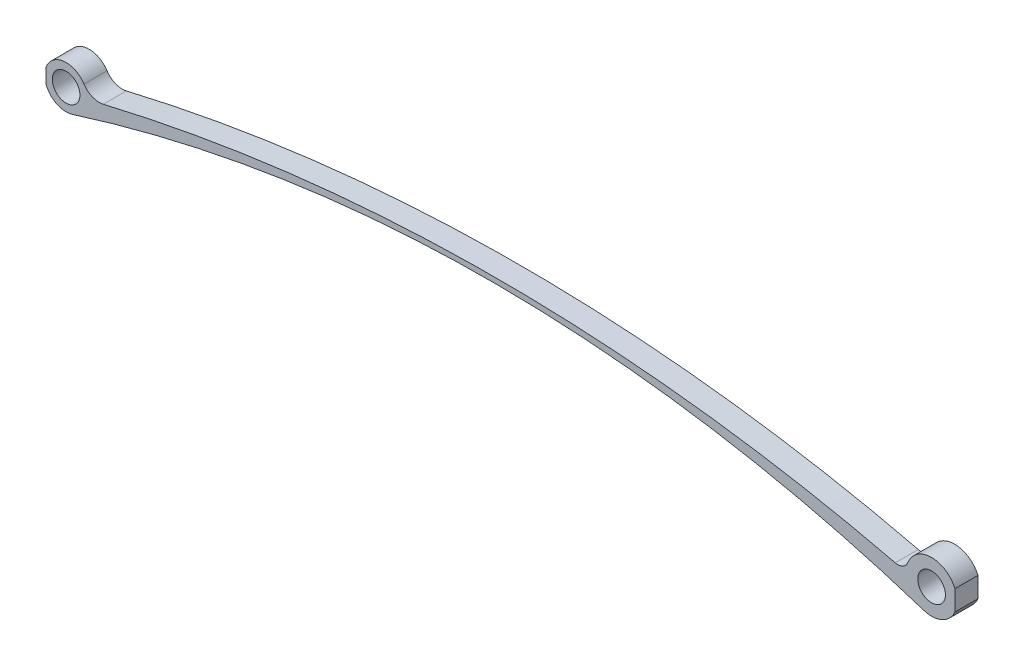
ISO-10303-21;
HEADER;
FILE_DESCRIPTION(('STEP AP214'),'2;1');
FILE_NAME('part.step','',(''),(''),'','','');
FILE_SCHEMA(('AUTOMOTIVE_DESIGN { 1 0 10303 214 1 1 1 1 }'));
ENDSEC;
DATA;
#1=APPLICATION_CONTEXT('core data for automotive mechanical design processes');
#2=APPLICATION_PROTOCOL_DEFINITION('international standard','automotive_design',2000,#1);
#3=PRODUCT_CONTEXT('',#1,'mechanical');
#4=PRODUCT('Part','Part','',(#3));
#5=PRODUCT_RELATED_PRODUCT_CATEGORY('part','',(#4));
#6=PRODUCT_DEFINITION_FORMATION('','',#4);
#7=PRODUCT_DEFINITION_CONTEXT('part definition',#1,'design');
#8=PRODUCT_DEFINITION('design','',#6,#7);
#9=PRODUCT_DEFINITION_SHAPE('','',#8);
#10=(LENGTH_UNIT() NAMED_UNIT(*) SI_UNIT(.MILLI.,.METRE.));
#11=(NAMED_UNIT(*) PLANE_ANGLE_UNIT() SI_UNIT($,.RADIAN.));
#12=(NAMED_UNIT(*) SI_UNIT($,.STERADIAN.) SOLID_ANGLE_UNIT());
#13=UNCERTAINTY_MEASURE_WITH_UNIT(LENGTH_MEASURE(1.E-05),#10,'distance_accuracy_value','');
#14=(GEOMETRIC_REPRESENTATION_CONTEXT(3) GLOBAL_UNCERTAINTY_ASSIGNED_CONTEXT((#13)) GLOBAL_UNIT_ASSIGNED_CONTEXT((#10,
#11,#12)) REPRESENTATION_CONTEXT('',''));
#15=CARTESIAN_POINT('',(0.,0.,0.));
#16=DIRECTION('',(0.,0.,1.));
#17=DIRECTION('',(1.,0.,0.));
#18=AXIS2_PLACEMENT_3D('',#15,#16,#17);
#19=CARTESIAN_POINT('',(46.2166343916436,-145.804835685392,5.));
#20=DIRECTION('',(0.,0.,1.));
#21=DIRECTION('',(1.,0.,0.));
#22=AXIS2_PLACEMENT_3D('',#19,#20,#21);
#23=PLANE('',#22);
#24=CARTESIAN_POINT('',(0.,0.,5.));
#25=DIRECTION('',(0.,0.,1.));
#26=DIRECTION('',(1.,0.,0.));
#27=AXIS2_PLACEMENT_3D('',#24,#25,#26);
#28=CIRCLE('',#27,3.00000007924961);
#29=CARTESIAN_POINT('',(3.00000007924961,0.,5.));
#30=VERTEX_POINT('',#29);
#31=EDGE_CURVE('E177',#30,#30,#28,.T.);
#32=ORIENTED_EDGE('',*,*,#31,.F.);
#33=EDGE_LOOP('',(#32));
#34=FACE_BOUND('',#33,.T.);
#35=CARTESIAN_POINT('',(187.7624,0.,5.));
#36=DIRECTION('',(0.,0.,1.));
#37=DIRECTION('',(1.,0.,0.));
#38=AXIS2_PLACEMENT_3D('',#35,#36,#37);
#39=CIRCLE('',#38,3.00000007924962);
#40=CARTESIAN_POINT('',(190.76240007925,0.,5.));
#41=VERTEX_POINT('',#40);
#42=EDGE_CURVE('E207',#41,#41,#39,.T.);
#43=ORIENTED_EDGE('',*,*,#42,.F.);
#44=EDGE_LOOP('',(#43));
#45=FACE_BOUND('',#44,.T.);
#46=CARTESIAN_POINT('',(0.,0.,5.));
#47=DIRECTION('',(0.,0.,1.));
#48=DIRECTION('',(1.,0.,0.));
#49=AXIS2_PLACEMENT_3D('',#46,#47,#48);
#50=CIRCLE('',#49,4.63518821296482);
#51=CARTESIAN_POINT('',(3.8882462198226,2.52319462262491,5.));
#52=VERTEX_POINT('',#51);
#53=CARTESIAN_POINT('',(-4.35681947691644,1.58211687784737,5.));
#54=VERTEX_POINT('',#53);
#55=EDGE_CURVE('E142',#52,#54,#50,.T.);
#56=ORIENTED_EDGE('',*,*,#55,.T.);
#57=DIRECTION('',(0.,1.,0.));
#58=VECTOR('',#57,1.);
#59=CARTESIAN_POINT('',(-4.35681947691644,0.,5.));
#60=LINE('',#59,#58);
#61=CARTESIAN_POINT('',(-4.35681947691644,-1.58211687784737,5.));
#62=VERTEX_POINT('',#61);
#63=EDGE_CURVE('E112',#62,#54,#60,.T.);
#64=ORIENTED_EDGE('',*,*,#63,.F.);
#65=CARTESIAN_POINT('',(1.40056706748754,-4.41852709158576,5.));
#66=VERTEX_POINT('',#65);
#67=EDGE_CURVE('E162',#62,#66,#50,.T.);
#68=ORIENTED_EDGE('',*,*,#67,.T.);
#69=CARTESIAN_POINT('',(92.4332687832871,-291.609671370783,5.));
#70=DIRECTION('',(0.,0.,-1.));
#71=DIRECTION('',(1.,0.,0.));
#72=AXIS2_PLACEMENT_3D('',#69,#70,#71);
#73=CIRCLE('',#72,301.273473996754);
#74=CARTESIAN_POINT('',(186.046385231382,-5.24925063679274,5.));
#75=VERTEX_POINT('',#74);
#76=EDGE_CURVE('E130',#66,#75,#73,.T.);
#77=ORIENTED_EDGE('',*,*,#76,.T.);
#78=CARTESIAN_POINT('',(187.7624,0.,5.));
#79=DIRECTION('',(0.,0.,1.));
#80=DIRECTION('',(1.,0.,0.));
#81=AXIS2_PLACEMENT_3D('',#78,#79,#80);
#82=CIRCLE('',#81,5.52262065816451);
#83=CARTESIAN_POINT('',(192.829341952088,-2.19668800428202,5.));
#84=VERTEX_POINT('',#83);
#85=EDGE_CURVE('E199',#75,#84,#82,.T.);
#86=ORIENTED_EDGE('',*,*,#85,.T.);
#87=DIRECTION('',(0.,-1.,0.));
#88=VECTOR('',#87,1.);
#89=CARTESIAN_POINT('',(192.829341952088,0.,5.));
#90=LINE('',#89,#88);
#91=CARTESIAN_POINT('',(192.829341952088,2.19668800428202,5.));
#92=VERTEX_POINT('',#91);
#93=EDGE_CURVE('E213',#92,#84,#90,.T.);
#94=ORIENTED_EDGE('',*,*,#93,.F.);
#95=CARTESIAN_POINT('',(182.617563383435,2.00748477524475,5.));
#96=VERTEX_POINT('',#95);
#97=EDGE_CURVE('E133',#92,#96,#82,.T.);
#98=ORIENTED_EDGE('',*,*,#97,.T.);
#99=CARTESIAN_POINT('',(180.426802915237,2.86230653420144,5.));
#100=DIRECTION('',(0.,0.,-1.));
#101=DIRECTION('',(1.,0.,0.));
#102=AXIS2_PLACEMENT_3D('',#99,#100,#101);
#103=CIRCLE('',#102,2.35162745106603);
#104=CARTESIAN_POINT('',(179.877474491306,0.575739248668494,5.));
#105=VERTEX_POINT('',#104);
#106=EDGE_CURVE('E198',#96,#105,#103,.T.);
#107=ORIENTED_EDGE('',*,*,#106,.T.);
#108=CARTESIAN_POINT('',(93.4374837774001,-359.228789914366,5.));
#109=DIRECTION('',(0.,0.,1.));
#110=DIRECTION('',(1.,0.,0.));
#111=AXIS2_PLACEMENT_3D('',#108,#109,#110);
#112=CIRCLE('',#111,370.042120846875);
#113=CARTESIAN_POINT('',(8.09398783884522,0.837396920553271,5.));
#114=VERTEX_POINT('',#113);
#115=EDGE_CURVE('E169',#105,#114,#112,.T.);
#116=ORIENTED_EDGE('',*,*,#115,.T.);
#117=CARTESIAN_POINT('',(7.18703059895712,4.66387053049246,5.));
#118=DIRECTION('',(0.,0.,-1.));
#119=DIRECTION('',(1.,0.,0.));
#120=AXIS2_PLACEMENT_3D('',#117,#118,#119);
#121=CIRCLE('',#120,3.93248925269307);
#122=EDGE_CURVE('E167',#114,#52,#121,.T.);
#123=ORIENTED_EDGE('',*,*,#122,.T.);
#124=EDGE_LOOP('',(#56,#64,#68,#77,#86,#94,#98,#107,#116,#123));
#125=FACE_BOUND('',#124,.T.);
#126=ADVANCED_FACE('F36',(#34,#45,#125),#23,.T.);
#127=CARTESIAN_POINT('',(46.2166343916436,-145.804835685392,0.));
#128=DIRECTION('',(0.,0.,1.));
#129=DIRECTION('',(1.,0.,0.));
#130=AXIS2_PLACEMENT_3D('',#127,#128,#129);
#131=PLANE('',#130);
#132=CARTESIAN_POINT('',(0.,0.,0.));
#133=DIRECTION('',(0.,0.,1.));
#134=DIRECTION('',(1.,0.,0.));
#135=AXIS2_PLACEMENT_3D('',#132,#133,#134);
#136=CIRCLE('',#135,3.00000007924961);
#137=CARTESIAN_POINT('',(3.00000007924961,0.,0.));
#138=VERTEX_POINT('',#137);
#139=EDGE_CURVE('E204',#138,#138,#136,.T.);
#140=ORIENTED_EDGE('',*,*,#139,.T.);
#141=EDGE_LOOP('',(#140));
#142=FACE_BOUND('',#141,.T.);
#143=CARTESIAN_POINT('',(187.7624,0.,0.));
#144=DIRECTION('',(0.,0.,1.));
#145=DIRECTION('',(1.,0.,0.));
#146=AXIS2_PLACEMENT_3D('',#143,#144,#145);
#147=CIRCLE('',#146,3.00000007924962);
#148=CARTESIAN_POINT('',(190.76240007925,0.,0.));
#149=VERTEX_POINT('',#148);
#150=EDGE_CURVE('E210',#149,#149,#147,.T.);
#151=ORIENTED_EDGE('',*,*,#150,.T.);
#152=EDGE_LOOP('',(#151));
#153=FACE_BOUND('',#152,.T.);
#154=DIRECTION('',(0.,1.,0.));
#155=VECTOR('',#154,1.);
#156=CARTESIAN_POINT('',(-4.35681947691644,0.,0.));
#157=LINE('',#156,#155);
#158=CARTESIAN_POINT('',(-4.35681947691644,-1.58211687784737,0.));
#159=VERTEX_POINT('',#158);
#160=CARTESIAN_POINT('',(-4.35681947691644,1.58211687784737,0.));
#161=VERTEX_POINT('',#160);
#162=EDGE_CURVE('E50',#159,#161,#157,.T.);
#163=ORIENTED_EDGE('',*,*,#162,.T.);
#164=CARTESIAN_POINT('',(0.,0.,0.));
#165=DIRECTION('',(0.,0.,1.));
#166=DIRECTION('',(1.,0.,0.));
#167=AXIS2_PLACEMENT_3D('',#164,#165,#166);
#168=CIRCLE('',#167,4.63518821296482);
#169=CARTESIAN_POINT('',(3.8882462198226,2.52319462262491,0.));
#170=VERTEX_POINT('',#169);
#171=EDGE_CURVE('E122',#170,#161,#168,.T.);
#172=ORIENTED_EDGE('',*,*,#171,.F.);
#173=CARTESIAN_POINT('',(7.18703059895712,4.66387053049246,0.));
#174=DIRECTION('',(0.,0.,-1.));
#175=DIRECTION('',(1.,0.,0.));
#176=AXIS2_PLACEMENT_3D('',#173,#174,#175);
#177=CIRCLE('',#176,3.93248925269307);
#178=CARTESIAN_POINT('',(8.09398783884522,0.837396920553271,0.));
#179=VERTEX_POINT('',#178);
#180=EDGE_CURVE('E135',#179,#170,#177,.T.);
#181=ORIENTED_EDGE('',*,*,#180,.F.);
#182=CARTESIAN_POINT('',(93.4374837774001,-359.228789914366,0.));
#183=DIRECTION('',(0.,0.,1.));
#184=DIRECTION('',(1.,0.,0.));
#185=AXIS2_PLACEMENT_3D('',#182,#183,#184);
#186=CIRCLE('',#185,370.042120846875);
#187=CARTESIAN_POINT('',(179.877474491306,0.575739248668494,0.));
#188=VERTEX_POINT('',#187);
#189=EDGE_CURVE('E182',#188,#179,#186,.T.);
#190=ORIENTED_EDGE('',*,*,#189,.F.);
#191=CARTESIAN_POINT('',(180.426802915237,2.86230653420144,0.));
#192=DIRECTION('',(0.,0.,-1.));
#193=DIRECTION('',(1.,0.,0.));
#194=AXIS2_PLACEMENT_3D('',#191,#192,#193);
#195=CIRCLE('',#194,2.35162745106603);
#196=CARTESIAN_POINT('',(182.617563383435,2.00748477524475,0.));
#197=VERTEX_POINT('',#196);
#198=EDGE_CURVE('E181',#197,#188,#195,.T.);
#199=ORIENTED_EDGE('',*,*,#198,.F.);
#200=CARTESIAN_POINT('',(187.7624,0.,0.));
#201=DIRECTION('',(0.,0.,1.));
#202=DIRECTION('',(1.,0.,0.));
#203=AXIS2_PLACEMENT_3D('',#200,#201,#202);
#204=CIRCLE('',#203,5.52262065816451);
#205=CARTESIAN_POINT('',(192.829341952088,2.19668800428202,0.));
#206=VERTEX_POINT('',#205);
#207=EDGE_CURVE('E176',#206,#197,#204,.T.);
#208=ORIENTED_EDGE('',*,*,#207,.F.);
#209=DIRECTION('',(0.,-1.,0.));
#210=VECTOR('',#209,1.);
#211=CARTESIAN_POINT('',(192.829341952088,0.,0.));
#212=LINE('',#211,#210);
#213=CARTESIAN_POINT('',(192.829341952088,-2.19668800428202,0.));
#214=VERTEX_POINT('',#213);
#215=EDGE_CURVE('E58',#206,#214,#212,.T.);
#216=ORIENTED_EDGE('',*,*,#215,.T.);
#217=CARTESIAN_POINT('',(186.046385231382,-5.24925063679274,0.));
#218=VERTEX_POINT('',#217);
#219=EDGE_CURVE('E178',#218,#214,#204,.T.);
#220=ORIENTED_EDGE('',*,*,#219,.F.);
#221=CARTESIAN_POINT('',(92.4332687832871,-291.609671370783,0.));
#222=DIRECTION('',(0.,0.,-1.));
#223=DIRECTION('',(1.,0.,0.));
#224=AXIS2_PLACEMENT_3D('',#221,#222,#223);
#225=CIRCLE('',#224,301.273473996754);
#226=CARTESIAN_POINT('',(1.40056706748754,-4.41852709158576,0.));
#227=VERTEX_POINT('',#226);
#228=EDGE_CURVE('E173',#227,#218,#225,.T.);
#229=ORIENTED_EDGE('',*,*,#228,.F.);
#230=EDGE_CURVE('E124',#159,#227,#168,.T.);
#231=ORIENTED_EDGE('',*,*,#230,.F.);
#232=EDGE_LOOP('',(#163,#172,#181,#190,#199,#208,#216,#220,#229,#231));
#233=FACE_BOUND('',#232,.T.);
#234=ADVANCED_FACE('F120',(#142,#153,#233),#131,.F.);
#235=CARTESIAN_POINT('',(0.,0.,5.));
#236=DIRECTION('',(0.,0.,-1.));
#237=DIRECTION('',(-1.,0.,0.));
#238=AXIS2_PLACEMENT_3D('',#235,#236,#237);
#239=CYLINDRICAL_SURFACE('',#238,4.63518821296482);
#240=DIRECTION('',(0.,0.,-1.));
#241=VECTOR('',#240,1.);
#242=CARTESIAN_POINT('',(-4.35681947691644,1.58211687784737,5.));
#243=LINE('',#242,#241);
#244=EDGE_CURVE('E11',#54,#161,#243,.T.);
#245=ORIENTED_EDGE('',*,*,#244,.F.);
#246=ORIENTED_EDGE('',*,*,#55,.F.);
#247=DIRECTION('',(0.,0.,-1.));
#248=VECTOR('',#247,1.);
#249=CARTESIAN_POINT('',(3.8882462198226,2.52319462262491,5.));
#250=LINE('',#249,#248);
#251=EDGE_CURVE('E129',#52,#170,#250,.T.);
#252=ORIENTED_EDGE('',*,*,#251,.T.);
#253=ORIENTED_EDGE('',*,*,#171,.T.);
#254=EDGE_LOOP('',(#245,#246,#252,#253));
#255=FACE_BOUND('',#254,.T.);
#256=ADVANCED_FACE('F127',(#255),#239,.T.);
#257=DIRECTION('',(0.,0.,-1.));
#258=VECTOR('',#257,1.);
#259=CARTESIAN_POINT('',(-4.35681947691644,-1.58211687784737,5.));
#260=LINE('',#259,#258);
#261=EDGE_CURVE('E44',#159,#62,#260,.F.);
#262=ORIENTED_EDGE('',*,*,#261,.F.);
#263=ORIENTED_EDGE('',*,*,#230,.T.);
#264=DIRECTION('',(0.,0.,-1.));
#265=VECTOR('',#264,1.);
#266=CARTESIAN_POINT('',(1.40056706748754,-4.41852709158576,5.));
#267=LINE('',#266,#265);
#268=EDGE_CURVE('E139',#66,#227,#267,.T.);
#269=ORIENTED_EDGE('',*,*,#268,.F.);
#270=ORIENTED_EDGE('',*,*,#67,.F.);
#271=EDGE_LOOP('',(#262,#263,#269,#270));
#272=FACE_BOUND('',#271,.T.);
#273=ADVANCED_FACE('F165',(#272),#239,.T.);
#274=CARTESIAN_POINT('',(187.7624,0.,5.));
#275=DIRECTION('',(0.,0.,-1.));
#276=DIRECTION('',(-1.,0.,0.));
#277=AXIS2_PLACEMENT_3D('',#274,#275,#276);
#278=CYLINDRICAL_SURFACE('',#277,5.52262065816451);
#279=DIRECTION('',(0.,0.,-1.));
#280=VECTOR('',#279,1.);
#281=CARTESIAN_POINT('',(192.829341952088,-2.19668800428202,5.));
#282=LINE('',#281,#280);
#283=EDGE_CURVE('E158',#84,#214,#282,.T.);
#284=ORIENTED_EDGE('',*,*,#283,.F.);
#285=ORIENTED_EDGE('',*,*,#85,.F.);
#286=DIRECTION('',(0.,0.,-1.));
#287=VECTOR('',#286,1.);
#288=CARTESIAN_POINT('',(186.046385231382,-5.24925063679274,5.));
#289=LINE('',#288,#287);
#290=EDGE_CURVE('E153',#75,#218,#289,.T.);
#291=ORIENTED_EDGE('',*,*,#290,.T.);
#292=ORIENTED_EDGE('',*,*,#219,.T.);
#293=EDGE_LOOP('',(#284,#285,#291,#292));
#294=FACE_BOUND('',#293,.T.);
#295=ADVANCED_FACE('F222',(#294),#278,.T.);
#296=DIRECTION('',(0.,0.,-1.));
#297=VECTOR('',#296,1.);
#298=CARTESIAN_POINT('',(192.829341952088,2.19668800428202,5.));
#299=LINE('',#298,#297);
#300=EDGE_CURVE('E156',#206,#92,#299,.F.);
#301=ORIENTED_EDGE('',*,*,#300,.F.);
#302=ORIENTED_EDGE('',*,*,#207,.T.);
#303=DIRECTION('',(0.,0.,-1.));
#304=VECTOR('',#303,1.);
#305=CARTESIAN_POINT('',(182.617563383435,2.00748477524475,5.));
#306=LINE('',#305,#304);
#307=EDGE_CURVE('E150',#96,#197,#306,.T.);
#308=ORIENTED_EDGE('',*,*,#307,.F.);
#309=ORIENTED_EDGE('',*,*,#97,.F.);
#310=EDGE_LOOP('',(#301,#302,#308,#309));
#311=FACE_BOUND('',#310,.T.);
#312=ADVANCED_FACE('F226',(#311),#278,.T.);
#313=CARTESIAN_POINT('',(92.4332687832871,-291.609671370783,5.));
#314=DIRECTION('',(0.,0.,-1.));
#315=DIRECTION('',(-1.,0.,0.));
#316=AXIS2_PLACEMENT_3D('',#313,#314,#315);
#317=CYLINDRICAL_SURFACE('',#316,301.273473996754);
#318=ORIENTED_EDGE('',*,*,#228,.T.);
#319=ORIENTED_EDGE('',*,*,#290,.F.);
#320=ORIENTED_EDGE('',*,*,#76,.F.);
#321=ORIENTED_EDGE('',*,*,#268,.T.);
#322=EDGE_LOOP('',(#318,#319,#320,#321));
#323=FACE_BOUND('',#322,.T.);
#324=ADVANCED_FACE('F38',(#323),#317,.F.);
#325=CARTESIAN_POINT('',(180.426802915237,2.86230653420144,5.));
#326=DIRECTION('',(0.,0.,-1.));
#327=DIRECTION('',(-1.,0.,0.));
#328=AXIS2_PLACEMENT_3D('',#325,#326,#327);
#329=CYLINDRICAL_SURFACE('',#328,2.35162745106603);
#330=ORIENTED_EDGE('',*,*,#198,.T.);
#331=DIRECTION('',(0.,0.,-1.));
#332=VECTOR('',#331,1.);
#333=CARTESIAN_POINT('',(179.877474491306,0.575739248668494,5.));
#334=LINE('',#333,#332);
#335=EDGE_CURVE('E147',#105,#188,#334,.T.);
#336=ORIENTED_EDGE('',*,*,#335,.F.);
#337=ORIENTED_EDGE('',*,*,#106,.F.);
#338=ORIENTED_EDGE('',*,*,#307,.T.);
#339=EDGE_LOOP('',(#330,#336,#337,#338));
#340=FACE_BOUND('',#339,.T.);
#341=ADVANCED_FACE('F193',(#340),#329,.F.);
#342=CARTESIAN_POINT('',(93.4374837774001,-359.228789914366,5.));
#343=DIRECTION('',(0.,0.,-1.));
#344=DIRECTION('',(-1.,0.,0.));
#345=AXIS2_PLACEMENT_3D('',#342,#343,#344);
#346=CYLINDRICAL_SURFACE('',#345,370.042120846875);
#347=ORIENTED_EDGE('',*,*,#189,.T.);
#348=DIRECTION('',(0.,0.,-1.));
#349=VECTOR('',#348,1.);
#350=CARTESIAN_POINT('',(8.09398783884522,0.837396920553271,5.));
#351=LINE('',#350,#349);
#352=EDGE_CURVE('E144',#114,#179,#351,.T.);
#353=ORIENTED_EDGE('',*,*,#352,.F.);
#354=ORIENTED_EDGE('',*,*,#115,.F.);
#355=ORIENTED_EDGE('',*,*,#335,.T.);
#356=EDGE_LOOP('',(#347,#353,#354,#355));
#357=FACE_BOUND('',#356,.T.);
#358=ADVANCED_FACE('F197',(#357),#346,.T.);
#359=CARTESIAN_POINT('',(7.18703059895712,4.66387053049246,5.));
#360=DIRECTION('',(0.,0.,-1.));
#361=DIRECTION('',(-1.,0.,0.));
#362=AXIS2_PLACEMENT_3D('',#359,#360,#361);
#363=CYLINDRICAL_SURFACE('',#362,3.93248925269307);
#364=ORIENTED_EDGE('',*,*,#180,.T.);
#365=ORIENTED_EDGE('',*,*,#251,.F.);
#366=ORIENTED_EDGE('',*,*,#122,.F.);
#367=ORIENTED_EDGE('',*,*,#352,.T.);
#368=EDGE_LOOP('',(#364,#365,#366,#367));
#369=FACE_BOUND('',#368,.T.);
#370=ADVANCED_FACE('F187',(#369),#363,.F.);
#371=CARTESIAN_POINT('',(0.,0.,5.));
#372=DIRECTION('',(0.,0.,-1.));
#373=DIRECTION('',(-1.,0.,0.));
#374=AXIS2_PLACEMENT_3D('',#371,#372,#373);
#375=CYLINDRICAL_SURFACE('',#374,3.00000007924961);
#376=ORIENTED_EDGE('',*,*,#31,.T.);
#377=EDGE_LOOP('',(#376));
#378=FACE_BOUND('',#377,.T.);
#379=ORIENTED_EDGE('',*,*,#139,.F.);
#380=EDGE_LOOP('',(#379));
#381=FACE_BOUND('',#380,.T.);
#382=ADVANCED_FACE('F244',(#378,#381),#375,.F.);
#383=CARTESIAN_POINT('',(187.7624,0.,5.));
#384=DIRECTION('',(0.,0.,-1.));
#385=DIRECTION('',(-1.,0.,0.));
#386=AXIS2_PLACEMENT_3D('',#383,#384,#385);
#387=CYLINDRICAL_SURFACE('',#386,3.00000007924962);
#388=ORIENTED_EDGE('',*,*,#42,.T.);
#389=EDGE_LOOP('',(#388));
#390=FACE_BOUND('',#389,.T.);
#391=ORIENTED_EDGE('',*,*,#150,.F.);
#392=EDGE_LOOP('',(#391));
#393=FACE_BOUND('',#392,.T.);
#394=ADVANCED_FACE('F276',(#390,#393),#387,.F.);
#395=CARTESIAN_POINT('',(192.829341952088,0.,5.));
#396=DIRECTION('',(1.,0.,0.));
#397=DIRECTION('',(0.,0.,-1.));
#398=AXIS2_PLACEMENT_3D('',#395,#396,#397);
#399=PLANE('',#398);
#400=ORIENTED_EDGE('',*,*,#283,.T.);
#401=ORIENTED_EDGE('',*,*,#215,.F.);
#402=ORIENTED_EDGE('',*,*,#300,.T.);
#403=ORIENTED_EDGE('',*,*,#93,.T.);
#404=EDGE_LOOP('',(#400,#401,#402,#403));
#405=FACE_BOUND('',#404,.T.);
#406=ADVANCED_FACE('F219',(#405),#399,.T.);
#407=CARTESIAN_POINT('',(-4.35681947691644,0.,5.));
#408=DIRECTION('',(-1.,0.,0.));
#409=DIRECTION('',(0.,0.,1.));
#410=AXIS2_PLACEMENT_3D('',#407,#408,#409);
#411=PLANE('',#410);
#412=ORIENTED_EDGE('',*,*,#244,.T.);
#413=ORIENTED_EDGE('',*,*,#162,.F.);
#414=ORIENTED_EDGE('',*,*,#261,.T.);
#415=ORIENTED_EDGE('',*,*,#63,.T.);
#416=EDGE_LOOP('',(#412,#413,#414,#415));
#417=FACE_BOUND('',#416,.T.);
#418=ADVANCED_FACE('F110',(#417),#411,.T.);
#419=CLOSED_SHELL('',(#126,#234,#256,#273,#295,#312,#324,#341,#358,#370,#382,#394,#406,#418));
#420=MANIFOLD_SOLID_BREP('B2',#419);
#421=ADVANCED_BREP_SHAPE_REPRESENTATION('',(#18,#420),#14);
#422=SHAPE_DEFINITION_REPRESENTATION(#9,#421);
ENDSEC;
END-ISO-10303-21;
